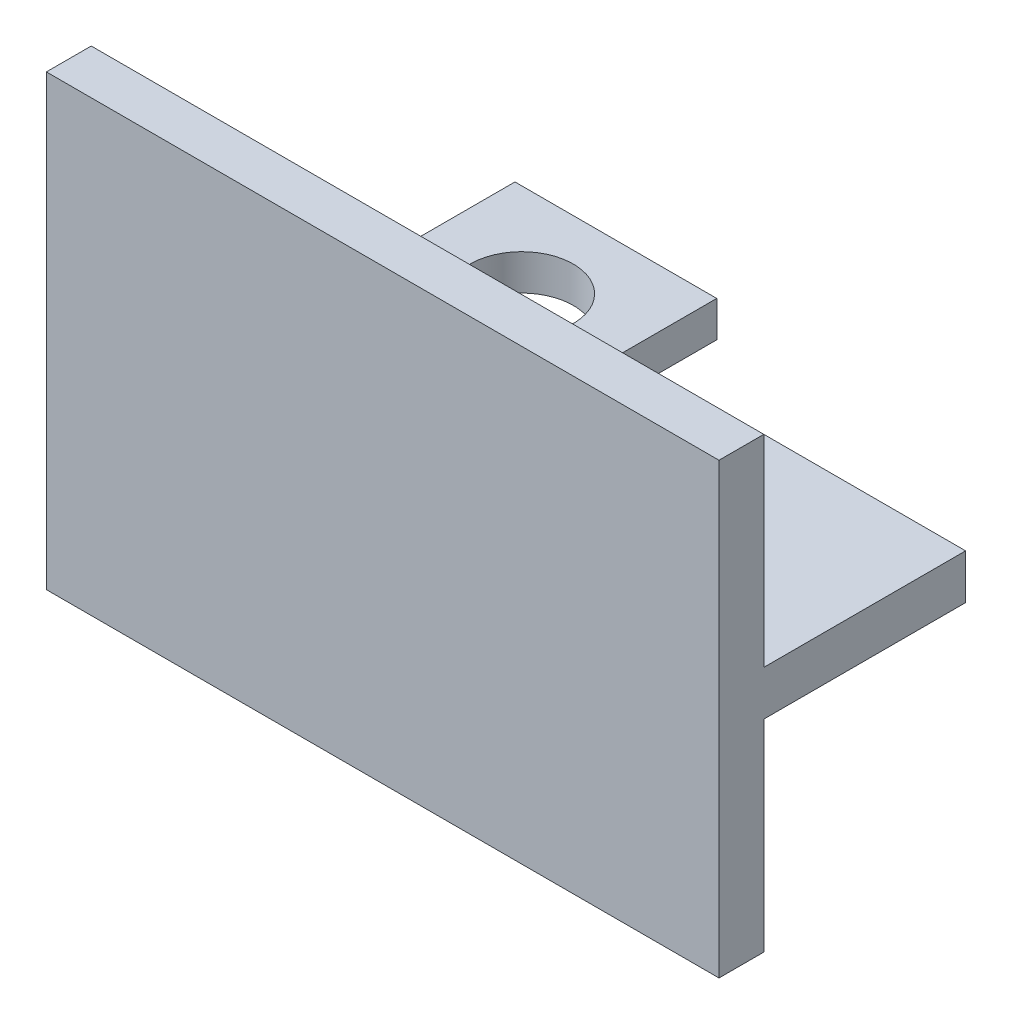
ISO-10303-21;
HEADER;
FILE_DESCRIPTION(('STEP AP214'),'2;1');
FILE_NAME('part.step','',(''),(''),'','','');
FILE_SCHEMA(('AUTOMOTIVE_DESIGN { 1 0 10303 214 1 1 1 1 }'));
ENDSEC;
DATA;
#1=APPLICATION_CONTEXT('core data for automotive mechanical design processes');
#2=APPLICATION_PROTOCOL_DEFINITION('international standard','automotive_design',2000,#1);
#3=PRODUCT_CONTEXT('',#1,'mechanical');
#4=PRODUCT('Part','Part','',(#3));
#5=PRODUCT_RELATED_PRODUCT_CATEGORY('part','',(#4));
#6=PRODUCT_DEFINITION_FORMATION('','',#4);
#7=PRODUCT_DEFINITION_CONTEXT('part definition',#1,'design');
#8=PRODUCT_DEFINITION('design','',#6,#7);
#9=PRODUCT_DEFINITION_SHAPE('','',#8);
#10=(LENGTH_UNIT() NAMED_UNIT(*) SI_UNIT(.MILLI.,.METRE.));
#11=(NAMED_UNIT(*) PLANE_ANGLE_UNIT() SI_UNIT($,.RADIAN.));
#12=(NAMED_UNIT(*) SI_UNIT($,.STERADIAN.) SOLID_ANGLE_UNIT());
#13=UNCERTAINTY_MEASURE_WITH_UNIT(LENGTH_MEASURE(1.E-05),#10,'distance_accuracy_value','');
#14=(GEOMETRIC_REPRESENTATION_CONTEXT(3) GLOBAL_UNCERTAINTY_ASSIGNED_CONTEXT((#13)) GLOBAL_UNIT_ASSIGNED_CONTEXT((#10,
#11,#12)) REPRESENTATION_CONTEXT('',''));
#15=CARTESIAN_POINT('',(0.,0.,0.));
#16=DIRECTION('',(0.,0.,1.));
#17=DIRECTION('',(1.,0.,0.));
#18=AXIS2_PLACEMENT_3D('',#15,#16,#17);
#19=CARTESIAN_POINT('',(37.7509069320464,883.250348045429,-55.));
#20=DIRECTION('',(0.,1.,0.));
#21=DIRECTION('',(0.,0.,1.));
#22=AXIS2_PLACEMENT_3D('',#19,#20,#21);
#23=PLANE('',#22);
#24=DIRECTION('',(1.,0.,0.));
#25=VECTOR('',#24,1.);
#26=CARTESIAN_POINT('',(37.7509069320464,883.250348045429,-10.));
#27=LINE('',#26,#25);
#28=CARTESIAN_POINT('',(37.7509069320464,883.250348045429,-10.));
#29=VERTEX_POINT('',#28);
#30=CARTESIAN_POINT('',(84.816182574132,883.250348045429,-10.));
#31=VERTEX_POINT('',#30);
#32=EDGE_CURVE('E171',#29,#31,#27,.T.);
#33=ORIENTED_EDGE('',*,*,#32,.T.);
#34=DIRECTION('',(0.,0.,-1.));
#35=VECTOR('',#34,1.);
#36=CARTESIAN_POINT('',(84.816182574132,883.250348045429,-10.));
#37=LINE('',#36,#35);
#38=CARTESIAN_POINT('',(84.816182574132,883.250348045429,-55.));
#39=VERTEX_POINT('',#38);
#40=EDGE_CURVE('E48',#31,#39,#37,.T.);
#41=ORIENTED_EDGE('',*,*,#40,.T.);
#42=DIRECTION('',(-1.,0.,0.));
#43=VECTOR('',#42,1.);
#44=CARTESIAN_POINT('',(37.7509069320464,883.250348045429,-55.));
#45=LINE('',#44,#43);
#46=CARTESIAN_POINT('',(37.7509069320464,883.250348045429,-55.));
#47=VERTEX_POINT('',#46);
#48=EDGE_CURVE('E192',#39,#47,#45,.T.);
#49=ORIENTED_EDGE('',*,*,#48,.T.);
#50=DIRECTION('',(0.,0.,1.));
#51=VECTOR('',#50,1.);
#52=CARTESIAN_POINT('',(37.7509069320464,883.250348045429,-55.));
#53=LINE('',#52,#51);
#54=EDGE_CURVE('E197',#47,#29,#53,.T.);
#55=ORIENTED_EDGE('',*,*,#54,.T.);
#56=EDGE_LOOP('',(#33,#41,#49,#55));
#57=FACE_BOUND('',#56,.T.);
#58=ADVANCED_FACE('F33',(#57),#23,.T.);
#59=CARTESIAN_POINT('',(187.750906932046,873.250348045429,-55.));
#60=DIRECTION('',(0.,-1.,0.));
#61=DIRECTION('',(0.,0.,-1.));
#62=AXIS2_PLACEMENT_3D('',#59,#60,#61);
#63=PLANE('',#62);
#64=DIRECTION('',(1.,0.,0.));
#65=VECTOR('',#64,1.);
#66=CARTESIAN_POINT('',(187.750906932046,873.250348045429,-55.));
#67=LINE('',#66,#65);
#68=CARTESIAN_POINT('',(37.7509069320464,873.250348045429,-55.));
#69=VERTEX_POINT('',#68);
#70=CARTESIAN_POINT('',(84.816182574132,873.250348045429,-55.));
#71=VERTEX_POINT('',#70);
#72=EDGE_CURVE('E186',#69,#71,#67,.T.);
#73=ORIENTED_EDGE('',*,*,#72,.T.);
#74=DIRECTION('',(0.,0.,1.));
#75=VECTOR('',#74,1.);
#76=CARTESIAN_POINT('',(84.816182574132,873.250348045429,-55.));
#77=LINE('',#76,#75);
#78=CARTESIAN_POINT('',(84.816182574132,873.250348045429,-10.));
#79=VERTEX_POINT('',#78);
#80=EDGE_CURVE('E228',#71,#79,#77,.T.);
#81=ORIENTED_EDGE('',*,*,#80,.T.);
#82=DIRECTION('',(-1.,0.,0.));
#83=VECTOR('',#82,1.);
#84=CARTESIAN_POINT('',(187.750906932046,873.250348045429,-10.));
#85=LINE('',#84,#83);
#86=CARTESIAN_POINT('',(37.7509069320464,873.250348045429,-10.));
#87=VERTEX_POINT('',#86);
#88=EDGE_CURVE('E41',#79,#87,#85,.T.);
#89=ORIENTED_EDGE('',*,*,#88,.T.);
#90=DIRECTION('',(0.,0.,1.));
#91=VECTOR('',#90,1.);
#92=CARTESIAN_POINT('',(37.7509069320464,873.250348045429,-55.));
#93=LINE('',#92,#91);
#94=EDGE_CURVE('E194',#69,#87,#93,.T.);
#95=ORIENTED_EDGE('',*,*,#94,.F.);
#96=EDGE_LOOP('',(#73,#81,#89,#95));
#97=FACE_BOUND('',#96,.T.);
#98=ADVANCED_FACE('F213',(#97),#63,.T.);
#99=CARTESIAN_POINT('',(0.,0.,-55.));
#100=DIRECTION('',(0.,0.,-1.));
#101=DIRECTION('',(-1.,0.,0.));
#102=AXIS2_PLACEMENT_3D('',#99,#100,#101);
#103=PLANE('',#102);
#104=ORIENTED_EDGE('',*,*,#48,.F.);
#105=DIRECTION('',(0.,1.,0.));
#106=VECTOR('',#105,1.);
#107=CARTESIAN_POINT('',(84.816182574132,828.250348045429,-55.));
#108=LINE('',#107,#106);
#109=EDGE_CURVE('E220',#71,#39,#108,.T.);
#110=ORIENTED_EDGE('',*,*,#109,.F.);
#111=ORIENTED_EDGE('',*,*,#72,.F.);
#112=DIRECTION('',(0.,-1.,0.));
#113=VECTOR('',#112,1.);
#114=CARTESIAN_POINT('',(37.7509069320464,883.250348045429,-55.));
#115=LINE('',#114,#113);
#116=EDGE_CURVE('E181',#47,#69,#115,.T.);
#117=ORIENTED_EDGE('',*,*,#116,.F.);
#118=EDGE_LOOP('',(#104,#110,#111,#117));
#119=FACE_BOUND('',#118,.T.);
#120=ADVANCED_FACE('F219',(#119),#103,.T.);
#121=DIRECTION('',(0.,0.,-1.));
#122=VECTOR('',#121,1.);
#123=CARTESIAN_POINT('',(141.336751426545,883.250348045429,-10.));
#124=LINE('',#123,#122);
#125=CARTESIAN_POINT('',(141.336751426545,883.250348045429,-10.));
#126=VERTEX_POINT('',#125);
#127=CARTESIAN_POINT('',(141.336751426545,883.250348045429,-55.));
#128=VERTEX_POINT('',#127);
#129=EDGE_CURVE('E150',#126,#128,#124,.T.);
#130=ORIENTED_EDGE('',*,*,#129,.F.);
#131=CARTESIAN_POINT('',(187.750906932046,883.250348045429,-10.));
#132=VERTEX_POINT('',#131);
#133=EDGE_CURVE('E161',#126,#132,#27,.T.);
#134=ORIENTED_EDGE('',*,*,#133,.T.);
#135=DIRECTION('',(0.,0.,1.));
#136=VECTOR('',#135,1.);
#137=CARTESIAN_POINT('',(187.750906932046,883.250348045429,-55.));
#138=LINE('',#137,#136);
#139=CARTESIAN_POINT('',(187.750906932046,883.250348045429,-55.));
#140=VERTEX_POINT('',#139);
#141=EDGE_CURVE('E200',#140,#132,#138,.T.);
#142=ORIENTED_EDGE('',*,*,#141,.F.);
#143=EDGE_CURVE('E164',#140,#128,#45,.T.);
#144=ORIENTED_EDGE('',*,*,#143,.T.);
#145=EDGE_LOOP('',(#130,#134,#142,#144));
#146=FACE_BOUND('',#145,.T.);
#147=ADVANCED_FACE('F160',(#146),#23,.T.);
#148=DIRECTION('',(0.,0.,1.));
#149=VECTOR('',#148,1.);
#150=CARTESIAN_POINT('',(141.336751426545,873.250348045429,-55.));
#151=LINE('',#150,#149);
#152=CARTESIAN_POINT('',(141.336751426545,873.250348045429,-55.));
#153=VERTEX_POINT('',#152);
#154=CARTESIAN_POINT('',(141.336751426545,873.250348045429,-10.));
#155=VERTEX_POINT('',#154);
#156=EDGE_CURVE('E153',#153,#155,#151,.T.);
#157=ORIENTED_EDGE('',*,*,#156,.F.);
#158=CARTESIAN_POINT('',(187.750906932046,873.250348045429,-55.));
#159=VERTEX_POINT('',#158);
#160=EDGE_CURVE('E184',#153,#159,#67,.T.);
#161=ORIENTED_EDGE('',*,*,#160,.T.);
#162=DIRECTION('',(0.,0.,1.));
#163=VECTOR('',#162,1.);
#164=CARTESIAN_POINT('',(187.750906932046,873.250348045429,-55.));
#165=LINE('',#164,#163);
#166=CARTESIAN_POINT('',(187.750906932046,873.250348045429,-10.));
#167=VERTEX_POINT('',#166);
#168=EDGE_CURVE('E202',#159,#167,#165,.T.);
#169=ORIENTED_EDGE('',*,*,#168,.T.);
#170=EDGE_CURVE('E11',#167,#155,#85,.T.);
#171=ORIENTED_EDGE('',*,*,#170,.T.);
#172=EDGE_LOOP('',(#157,#161,#169,#171));
#173=FACE_BOUND('',#172,.T.);
#174=ADVANCED_FACE('F332',(#173),#63,.T.);
#175=CARTESIAN_POINT('',(37.7509069320464,883.250348045429,-55.));
#176=DIRECTION('',(-1.,0.,0.));
#177=DIRECTION('',(0.,-1.,0.));
#178=AXIS2_PLACEMENT_3D('',#175,#176,#177);
#179=PLANE('',#178);
#180=DIRECTION('',(0.,1.,0.));
#181=VECTOR('',#180,1.);
#182=CARTESIAN_POINT('',(37.7509069320464,828.250348045429,-10.));
#183=LINE('',#182,#181);
#184=CARTESIAN_POINT('',(37.7509069320464,928.250348045429,-10.));
#185=VERTEX_POINT('',#184);
#186=EDGE_CURVE('E177',#29,#185,#183,.T.);
#187=ORIENTED_EDGE('',*,*,#186,.F.);
#188=ORIENTED_EDGE('',*,*,#54,.F.);
#189=ORIENTED_EDGE('',*,*,#116,.T.);
#190=ORIENTED_EDGE('',*,*,#94,.T.);
#191=CARTESIAN_POINT('',(37.7509069320464,828.250348045429,-10.));
#192=VERTEX_POINT('',#191);
#193=EDGE_CURVE('E172',#192,#87,#183,.T.);
#194=ORIENTED_EDGE('',*,*,#193,.F.);
#195=DIRECTION('',(0.,0.,-1.));
#196=VECTOR('',#195,1.);
#197=CARTESIAN_POINT('',(37.7509069320464,828.250348045429,0.));
#198=LINE('',#197,#196);
#199=CARTESIAN_POINT('',(37.7509069320464,828.250348045429,0.));
#200=VERTEX_POINT('',#199);
#201=EDGE_CURVE('E268',#200,#192,#198,.T.);
#202=ORIENTED_EDGE('',*,*,#201,.F.);
#203=DIRECTION('',(0.,-1.,0.));
#204=VECTOR('',#203,1.);
#205=CARTESIAN_POINT('',(37.7509069320464,883.250348045429,0.));
#206=LINE('',#205,#204);
#207=CARTESIAN_POINT('',(37.7509069320464,928.250348045429,0.));
#208=VERTEX_POINT('',#207);
#209=EDGE_CURVE('E175',#208,#200,#206,.T.);
#210=ORIENTED_EDGE('',*,*,#209,.F.);
#211=DIRECTION('',(0.,0.,-1.));
#212=VECTOR('',#211,1.);
#213=CARTESIAN_POINT('',(37.7509069320464,928.250348045429,0.));
#214=LINE('',#213,#212);
#215=EDGE_CURVE('E252',#208,#185,#214,.T.);
#216=ORIENTED_EDGE('',*,*,#215,.T.);
#217=EDGE_LOOP('',(#187,#188,#189,#190,#194,#202,#210,#216));
#218=FACE_BOUND('',#217,.T.);
#219=ADVANCED_FACE('F35',(#218),#179,.T.);
#220=CARTESIAN_POINT('',(187.750906932046,883.250348045429,-55.));
#221=DIRECTION('',(1.,0.,0.));
#222=DIRECTION('',(0.,1.,0.));
#223=AXIS2_PLACEMENT_3D('',#220,#221,#222);
#224=PLANE('',#223);
#225=DIRECTION('',(0.,1.,0.));
#226=VECTOR('',#225,1.);
#227=CARTESIAN_POINT('',(187.750906932046,828.250348045429,-10.));
#228=LINE('',#227,#226);
#229=CARTESIAN_POINT('',(187.750906932046,828.250348045429,-10.));
#230=VERTEX_POINT('',#229);
#231=EDGE_CURVE('E278',#230,#167,#228,.T.);
#232=ORIENTED_EDGE('',*,*,#231,.T.);
#233=ORIENTED_EDGE('',*,*,#168,.F.);
#234=DIRECTION('',(0.,1.,0.));
#235=VECTOR('',#234,1.);
#236=CARTESIAN_POINT('',(187.750906932046,883.250348045429,-55.));
#237=LINE('',#236,#235);
#238=EDGE_CURVE('E189',#159,#140,#237,.T.);
#239=ORIENTED_EDGE('',*,*,#238,.T.);
#240=ORIENTED_EDGE('',*,*,#141,.T.);
#241=CARTESIAN_POINT('',(187.750906932046,928.250348045429,-10.));
#242=VERTEX_POINT('',#241);
#243=EDGE_CURVE('E169',#132,#242,#228,.T.);
#244=ORIENTED_EDGE('',*,*,#243,.T.);
#245=DIRECTION('',(0.,0.,-1.));
#246=VECTOR('',#245,1.);
#247=CARTESIAN_POINT('',(187.750906932046,928.250348045429,0.));
#248=LINE('',#247,#246);
#249=CARTESIAN_POINT('',(187.750906932046,928.250348045429,0.));
#250=VERTEX_POINT('',#249);
#251=EDGE_CURVE('E262',#250,#242,#248,.T.);
#252=ORIENTED_EDGE('',*,*,#251,.F.);
#253=DIRECTION('',(0.,1.,0.));
#254=VECTOR('',#253,1.);
#255=CARTESIAN_POINT('',(187.750906932046,883.250348045429,0.));
#256=LINE('',#255,#254);
#257=CARTESIAN_POINT('',(187.750906932046,828.250348045429,0.));
#258=VERTEX_POINT('',#257);
#259=EDGE_CURVE('E185',#258,#250,#256,.T.);
#260=ORIENTED_EDGE('',*,*,#259,.F.);
#261=DIRECTION('',(0.,0.,-1.));
#262=VECTOR('',#261,1.);
#263=CARTESIAN_POINT('',(187.750906932046,828.250348045429,0.));
#264=LINE('',#263,#262);
#265=EDGE_CURVE('E273',#258,#230,#264,.T.);
#266=ORIENTED_EDGE('',*,*,#265,.T.);
#267=EDGE_LOOP('',(#232,#233,#239,#240,#244,#252,#260,#266));
#268=FACE_BOUND('',#267,.T.);
#269=ADVANCED_FACE('F284',(#268),#224,.T.);
#270=DIRECTION('',(0.,1.,0.));
#271=VECTOR('',#270,1.);
#272=CARTESIAN_POINT('',(141.336751426545,828.250348045429,-55.));
#273=LINE('',#272,#271);
#274=EDGE_CURVE('E156',#153,#128,#273,.T.);
#275=ORIENTED_EDGE('',*,*,#274,.T.);
#276=ORIENTED_EDGE('',*,*,#143,.F.);
#277=ORIENTED_EDGE('',*,*,#238,.F.);
#278=ORIENTED_EDGE('',*,*,#160,.F.);
#279=EDGE_LOOP('',(#275,#276,#277,#278));
#280=FACE_BOUND('',#279,.T.);
#281=ADVANCED_FACE('F342',(#280),#103,.T.);
#282=CARTESIAN_POINT('',(0.,0.,0.));
#283=DIRECTION('',(0.,0.,-1.));
#284=DIRECTION('',(-1.,0.,0.));
#285=AXIS2_PLACEMENT_3D('',#282,#283,#284);
#286=PLANE('',#285);
#287=ORIENTED_EDGE('',*,*,#209,.T.);
#288=DIRECTION('',(1.,0.,0.));
#289=VECTOR('',#288,1.);
#290=CARTESIAN_POINT('',(37.7509069320464,828.250348045429,0.));
#291=LINE('',#290,#289);
#292=EDGE_CURVE('E276',#200,#258,#291,.T.);
#293=ORIENTED_EDGE('',*,*,#292,.T.);
#294=ORIENTED_EDGE('',*,*,#259,.T.);
#295=DIRECTION('',(1.,0.,0.));
#296=VECTOR('',#295,1.);
#297=CARTESIAN_POINT('',(37.7509069320464,928.250348045429,0.));
#298=LINE('',#297,#296);
#299=EDGE_CURVE('E265',#208,#250,#298,.T.);
#300=ORIENTED_EDGE('',*,*,#299,.F.);
#301=EDGE_LOOP('',(#287,#293,#294,#300));
#302=FACE_BOUND('',#301,.T.);
#303=ADVANCED_FACE('F347',(#302),#286,.F.);
#304=CARTESIAN_POINT('',(0.,828.250348045429,0.));
#305=DIRECTION('',(0.,-1.,0.));
#306=DIRECTION('',(0.,0.,-1.));
#307=AXIS2_PLACEMENT_3D('',#304,#305,#306);
#308=PLANE('',#307);
#309=ORIENTED_EDGE('',*,*,#201,.T.);
#310=DIRECTION('',(1.,0.,0.));
#311=VECTOR('',#310,1.);
#312=CARTESIAN_POINT('',(37.7509069320464,828.250348045429,-10.));
#313=LINE('',#312,#311);
#314=EDGE_CURVE('E271',#192,#230,#313,.T.);
#315=ORIENTED_EDGE('',*,*,#314,.T.);
#316=ORIENTED_EDGE('',*,*,#265,.F.);
#317=ORIENTED_EDGE('',*,*,#292,.F.);
#318=EDGE_LOOP('',(#309,#315,#316,#317));
#319=FACE_BOUND('',#318,.T.);
#320=ADVANCED_FACE('F353',(#319),#308,.T.);
#321=CARTESIAN_POINT('',(37.7509069320464,828.250348045429,-10.));
#322=DIRECTION('',(0.,0.,1.));
#323=DIRECTION('',(1.,0.,0.));
#324=AXIS2_PLACEMENT_3D('',#321,#322,#323);
#325=PLANE('',#324);
#326=DIRECTION('',(-1.,0.,0.));
#327=VECTOR('',#326,1.);
#328=CARTESIAN_POINT('',(135.250906932046,899.250348045429,-10.));
#329=LINE('',#328,#327);
#330=CARTESIAN_POINT('',(135.250906932046,899.250348045429,-10.));
#331=VERTEX_POINT('',#330);
#332=CARTESIAN_POINT('',(90.2509069320464,899.250348045429,-10.));
#333=VERTEX_POINT('',#332);
#334=EDGE_CURVE('E235',#331,#333,#329,.T.);
#335=ORIENTED_EDGE('',*,*,#334,.F.);
#336=DIRECTION('',(0.,1.,0.));
#337=VECTOR('',#336,1.);
#338=CARTESIAN_POINT('',(135.250906932046,899.250348045429,-10.));
#339=LINE('',#338,#337);
#340=CARTESIAN_POINT('',(135.250906932046,907.250348045429,-10.));
#341=VERTEX_POINT('',#340);
#342=EDGE_CURVE('E230',#331,#341,#339,.T.);
#343=ORIENTED_EDGE('',*,*,#342,.T.);
#344=DIRECTION('',(-1.,0.,0.));
#345=VECTOR('',#344,1.);
#346=CARTESIAN_POINT('',(135.250906932046,907.250348045429,-10.));
#347=LINE('',#346,#345);
#348=CARTESIAN_POINT('',(90.2509069320464,907.250348045429,-10.));
#349=VERTEX_POINT('',#348);
#350=EDGE_CURVE('E245',#341,#349,#347,.T.);
#351=ORIENTED_EDGE('',*,*,#350,.T.);
#352=DIRECTION('',(0.,1.,0.));
#353=VECTOR('',#352,1.);
#354=CARTESIAN_POINT('',(90.2509069320464,899.250348045429,-10.));
#355=LINE('',#354,#353);
#356=EDGE_CURVE('E56',#333,#349,#355,.T.);
#357=ORIENTED_EDGE('',*,*,#356,.F.);
#358=EDGE_LOOP('',(#335,#343,#351,#357));
#359=FACE_BOUND('',#358,.T.);
#360=ORIENTED_EDGE('',*,*,#32,.F.);
#361=ORIENTED_EDGE('',*,*,#186,.T.);
#362=DIRECTION('',(1.,0.,0.));
#363=VECTOR('',#362,1.);
#364=CARTESIAN_POINT('',(37.7509069320464,928.250348045429,-10.));
#365=LINE('',#364,#363);
#366=EDGE_CURVE('E260',#185,#242,#365,.T.);
#367=ORIENTED_EDGE('',*,*,#366,.T.);
#368=ORIENTED_EDGE('',*,*,#243,.F.);
#369=ORIENTED_EDGE('',*,*,#133,.F.);
#370=DIRECTION('',(0.,1.,0.));
#371=VECTOR('',#370,1.);
#372=CARTESIAN_POINT('',(141.336751426545,828.250348045429,-10.));
#373=LINE('',#372,#371);
#374=EDGE_CURVE('E147',#155,#126,#373,.T.);
#375=ORIENTED_EDGE('',*,*,#374,.F.);
#376=ORIENTED_EDGE('',*,*,#170,.F.);
#377=ORIENTED_EDGE('',*,*,#231,.F.);
#378=ORIENTED_EDGE('',*,*,#314,.F.);
#379=ORIENTED_EDGE('',*,*,#193,.T.);
#380=ORIENTED_EDGE('',*,*,#88,.F.);
#381=DIRECTION('',(0.,1.,0.));
#382=VECTOR('',#381,1.);
#383=CARTESIAN_POINT('',(84.816182574132,828.250348045429,-10.));
#384=LINE('',#383,#382);
#385=EDGE_CURVE('E221',#79,#31,#384,.T.);
#386=ORIENTED_EDGE('',*,*,#385,.T.);
#387=EDGE_LOOP('',(#360,#361,#367,#368,#369,#375,#376,#377,#378,#379,#380,#386));
#388=FACE_BOUND('',#387,.T.);
#389=ADVANCED_FACE('F167',(#359,#388),#325,.F.);
#390=CARTESIAN_POINT('',(0.,928.250348045429,0.));
#391=DIRECTION('',(0.,-1.,0.));
#392=DIRECTION('',(0.,0.,-1.));
#393=AXIS2_PLACEMENT_3D('',#390,#391,#392);
#394=PLANE('',#393);
#395=ORIENTED_EDGE('',*,*,#215,.F.);
#396=ORIENTED_EDGE('',*,*,#299,.T.);
#397=ORIENTED_EDGE('',*,*,#251,.T.);
#398=ORIENTED_EDGE('',*,*,#366,.F.);
#399=EDGE_LOOP('',(#395,#396,#397,#398));
#400=FACE_BOUND('',#399,.T.);
#401=ADVANCED_FACE('F288',(#400),#394,.F.);
#402=CARTESIAN_POINT('',(135.250906932046,899.250348045429,-52.));
#403=DIRECTION('',(1.,0.,0.));
#404=DIRECTION('',(0.,0.,-1.));
#405=AXIS2_PLACEMENT_3D('',#402,#403,#404);
#406=PLANE('',#405);
#407=ORIENTED_EDGE('',*,*,#342,.F.);
#408=DIRECTION('',(0.,0.,1.));
#409=VECTOR('',#408,1.);
#410=CARTESIAN_POINT('',(135.250906932046,899.250348045429,-52.));
#411=LINE('',#410,#409);
#412=CARTESIAN_POINT('',(135.250906932046,899.250348045429,-52.));
#413=VERTEX_POINT('',#412);
#414=EDGE_CURVE('E250',#413,#331,#411,.T.);
#415=ORIENTED_EDGE('',*,*,#414,.F.);
#416=DIRECTION('',(0.,1.,0.));
#417=VECTOR('',#416,1.);
#418=CARTESIAN_POINT('',(135.250906932046,899.250348045429,-52.));
#419=LINE('',#418,#417);
#420=CARTESIAN_POINT('',(135.250906932046,907.250348045429,-52.));
#421=VERTEX_POINT('',#420);
#422=EDGE_CURVE('E231',#413,#421,#419,.T.);
#423=ORIENTED_EDGE('',*,*,#422,.T.);
#424=DIRECTION('',(0.,0.,1.));
#425=VECTOR('',#424,1.);
#426=CARTESIAN_POINT('',(135.250906932046,907.250348045429,-52.));
#427=LINE('',#426,#425);
#428=EDGE_CURVE('E242',#421,#341,#427,.T.);
#429=ORIENTED_EDGE('',*,*,#428,.T.);
#430=EDGE_LOOP('',(#407,#415,#423,#429));
#431=FACE_BOUND('',#430,.T.);
#432=ADVANCED_FACE('F313',(#431),#406,.T.);
#433=CARTESIAN_POINT('',(135.250906932046,899.250348045429,-52.));
#434=DIRECTION('',(0.,1.,0.));
#435=DIRECTION('',(0.,0.,1.));
#436=AXIS2_PLACEMENT_3D('',#433,#434,#435);
#437=PLANE('',#436);
#438=CARTESIAN_POINT('',(112.600906932049,899.250348045429,-31.15));
#439=DIRECTION('',(0.,1.,0.));
#440=DIRECTION('',(0.,0.,1.));
#441=AXIS2_PLACEMENT_3D('',#438,#439,#440);
#442=CIRCLE('',#441,11.5);
#443=CARTESIAN_POINT('',(112.600906932049,899.250348045429,-19.65));
#444=VERTEX_POINT('',#443);
#445=EDGE_CURVE('E165',#444,#444,#442,.T.);
#446=ORIENTED_EDGE('',*,*,#445,.T.);
#447=EDGE_LOOP('',(#446));
#448=FACE_BOUND('',#447,.T.);
#449=ORIENTED_EDGE('',*,*,#334,.T.);
#450=DIRECTION('',(0.,0.,1.));
#451=VECTOR('',#450,1.);
#452=CARTESIAN_POINT('',(90.2509069320464,899.250348045429,-52.));
#453=LINE('',#452,#451);
#454=CARTESIAN_POINT('',(90.2509069320464,899.250348045429,-52.));
#455=VERTEX_POINT('',#454);
#456=EDGE_CURVE('E253',#455,#333,#453,.T.);
#457=ORIENTED_EDGE('',*,*,#456,.F.);
#458=DIRECTION('',(-1.,0.,0.));
#459=VECTOR('',#458,1.);
#460=CARTESIAN_POINT('',(135.250906932046,899.250348045429,-52.));
#461=LINE('',#460,#459);
#462=EDGE_CURVE('E240',#413,#455,#461,.T.);
#463=ORIENTED_EDGE('',*,*,#462,.F.);
#464=ORIENTED_EDGE('',*,*,#414,.T.);
#465=EDGE_LOOP('',(#449,#457,#463,#464));
#466=FACE_BOUND('',#465,.T.);
#467=ADVANCED_FACE('F320',(#448,#466),#437,.F.);
#468=CARTESIAN_POINT('',(90.2509069320464,899.250348045429,-52.));
#469=DIRECTION('',(1.,0.,0.));
#470=DIRECTION('',(0.,0.,-1.));
#471=AXIS2_PLACEMENT_3D('',#468,#469,#470);
#472=PLANE('',#471);
#473=ORIENTED_EDGE('',*,*,#356,.T.);
#474=DIRECTION('',(0.,0.,1.));
#475=VECTOR('',#474,1.);
#476=CARTESIAN_POINT('',(90.2509069320464,907.250348045429,-52.));
#477=LINE('',#476,#475);
#478=CARTESIAN_POINT('',(90.2509069320464,907.250348045429,-52.));
#479=VERTEX_POINT('',#478);
#480=EDGE_CURVE('E255',#479,#349,#477,.T.);
#481=ORIENTED_EDGE('',*,*,#480,.F.);
#482=DIRECTION('',(0.,1.,0.));
#483=VECTOR('',#482,1.);
#484=CARTESIAN_POINT('',(90.2509069320464,899.250348045429,-52.));
#485=LINE('',#484,#483);
#486=EDGE_CURVE('E238',#455,#479,#485,.T.);
#487=ORIENTED_EDGE('',*,*,#486,.F.);
#488=ORIENTED_EDGE('',*,*,#456,.T.);
#489=EDGE_LOOP('',(#473,#481,#487,#488));
#490=FACE_BOUND('',#489,.T.);
#491=ADVANCED_FACE('F305',(#490),#472,.F.);
#492=CARTESIAN_POINT('',(135.250906932046,907.250348045429,-52.));
#493=DIRECTION('',(0.,1.,0.));
#494=DIRECTION('',(0.,0.,1.));
#495=AXIS2_PLACEMENT_3D('',#492,#493,#494);
#496=PLANE('',#495);
#497=CARTESIAN_POINT('',(112.600906932049,907.250348045429,-31.15));
#498=DIRECTION('',(0.,1.,0.));
#499=DIRECTION('',(0.,0.,1.));
#500=AXIS2_PLACEMENT_3D('',#497,#498,#499);
#501=CIRCLE('',#500,11.5);
#502=CARTESIAN_POINT('',(112.600906932049,907.250348045429,-19.65));
#503=VERTEX_POINT('',#502);
#504=EDGE_CURVE('E294',#503,#503,#501,.T.);
#505=ORIENTED_EDGE('',*,*,#504,.F.);
#506=EDGE_LOOP('',(#505));
#507=FACE_BOUND('',#506,.T.);
#508=ORIENTED_EDGE('',*,*,#350,.F.);
#509=ORIENTED_EDGE('',*,*,#428,.F.);
#510=DIRECTION('',(-1.,0.,0.));
#511=VECTOR('',#510,1.);
#512=CARTESIAN_POINT('',(135.250906932046,907.250348045429,-52.));
#513=LINE('',#512,#511);
#514=EDGE_CURVE('E234',#421,#479,#513,.T.);
#515=ORIENTED_EDGE('',*,*,#514,.T.);
#516=ORIENTED_EDGE('',*,*,#480,.T.);
#517=EDGE_LOOP('',(#508,#509,#515,#516));
#518=FACE_BOUND('',#517,.T.);
#519=ADVANCED_FACE('F301',(#507,#518),#496,.T.);
#520=CARTESIAN_POINT('',(0.,0.,-52.));
#521=DIRECTION('',(0.,0.,1.));
#522=DIRECTION('',(1.,0.,0.));
#523=AXIS2_PLACEMENT_3D('',#520,#521,#522);
#524=PLANE('',#523);
#525=ORIENTED_EDGE('',*,*,#422,.F.);
#526=ORIENTED_EDGE('',*,*,#462,.T.);
#527=ORIENTED_EDGE('',*,*,#486,.T.);
#528=ORIENTED_EDGE('',*,*,#514,.F.);
#529=EDGE_LOOP('',(#525,#526,#527,#528));
#530=FACE_BOUND('',#529,.T.);
#531=ADVANCED_FACE('F304',(#530),#524,.F.);
#532=CARTESIAN_POINT('',(84.816182574132,828.250348045429,-10.));
#533=DIRECTION('',(1.,0.,0.));
#534=DIRECTION('',(0.,0.,-1.));
#535=AXIS2_PLACEMENT_3D('',#532,#533,#534);
#536=PLANE('',#535);
#537=ORIENTED_EDGE('',*,*,#109,.T.);
#538=ORIENTED_EDGE('',*,*,#40,.F.);
#539=ORIENTED_EDGE('',*,*,#385,.F.);
#540=ORIENTED_EDGE('',*,*,#80,.F.);
#541=EDGE_LOOP('',(#537,#538,#539,#540));
#542=FACE_BOUND('',#541,.T.);
#543=ADVANCED_FACE('F405',(#542),#536,.T.);
#544=CARTESIAN_POINT('',(141.336751426545,828.250348045429,-10.));
#545=DIRECTION('',(1.,0.,0.));
#546=DIRECTION('',(0.,0.,-1.));
#547=AXIS2_PLACEMENT_3D('',#544,#545,#546);
#548=PLANE('',#547);
#549=ORIENTED_EDGE('',*,*,#156,.T.);
#550=ORIENTED_EDGE('',*,*,#374,.T.);
#551=ORIENTED_EDGE('',*,*,#129,.T.);
#552=ORIENTED_EDGE('',*,*,#274,.F.);
#553=EDGE_LOOP('',(#549,#550,#551,#552));
#554=FACE_BOUND('',#553,.T.);
#555=ADVANCED_FACE('F149',(#554),#548,.F.);
#556=CARTESIAN_POINT('',(112.600906932049,828.250348045429,-31.15));
#557=DIRECTION('',(0.,1.,0.));
#558=DIRECTION('',(0.,0.,1.));
#559=AXIS2_PLACEMENT_3D('',#556,#557,#558);
#560=CYLINDRICAL_SURFACE('',#559,11.5);
#561=ORIENTED_EDGE('',*,*,#504,.T.);
#562=EDGE_LOOP('',(#561));
#563=FACE_BOUND('',#562,.T.);
#564=ORIENTED_EDGE('',*,*,#445,.F.);
#565=EDGE_LOOP('',(#564));
#566=FACE_BOUND('',#565,.T.);
#567=ADVANCED_FACE('F298',(#563,#566),#560,.F.);
#568=CLOSED_SHELL('',(#58,#98,#120,#147,#174,#219,#269,#281,#303,#320,#389,#401,#432,#467,#491,
#519,#531,#543,#555,#567));
#569=MANIFOLD_SOLID_BREP('B2',#568);
#570=ADVANCED_BREP_SHAPE_REPRESENTATION('',(#18,#569),#14);
#571=SHAPE_DEFINITION_REPRESENTATION(#9,#570);
ENDSEC;
END-ISO-10303-21;
